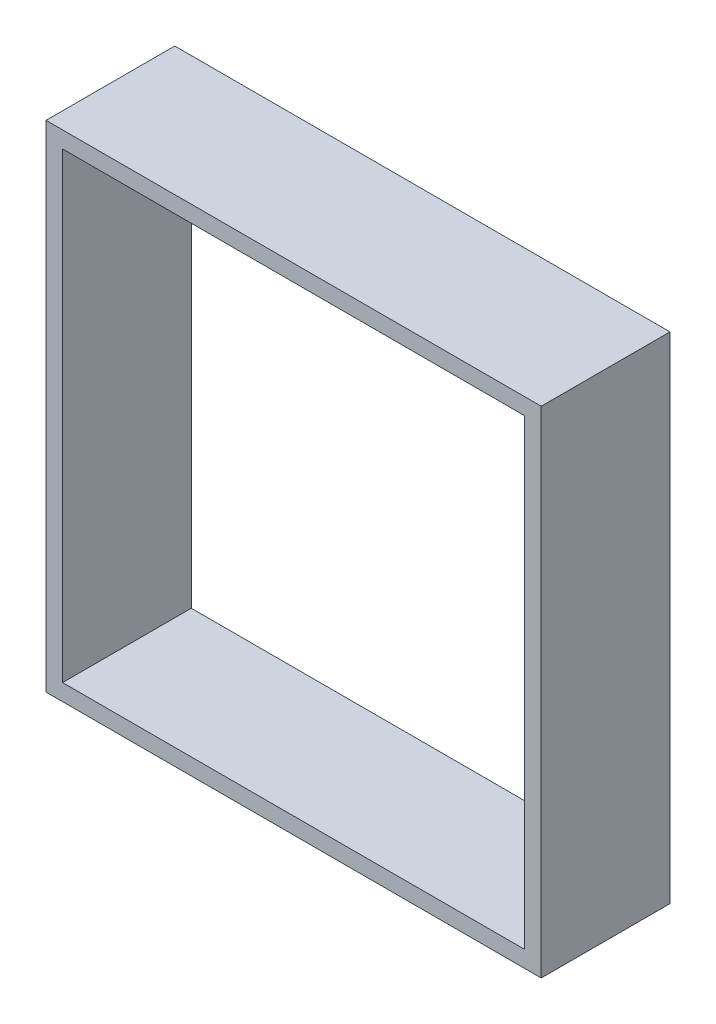
ISO-10303-21;
HEADER;
FILE_DESCRIPTION(('STEP AP214'),'2;1');
FILE_NAME('part.step','',(''),(''),'','','');
FILE_SCHEMA(('AUTOMOTIVE_DESIGN { 1 0 10303 214 1 1 1 1 }'));
ENDSEC;
DATA;
#1=APPLICATION_CONTEXT('core data for automotive mechanical design processes');
#2=APPLICATION_PROTOCOL_DEFINITION('international standard','automotive_design',2000,#1);
#3=PRODUCT_CONTEXT('',#1,'mechanical');
#4=PRODUCT('Part','Part','',(#3));
#5=PRODUCT_RELATED_PRODUCT_CATEGORY('part','',(#4));
#6=PRODUCT_DEFINITION_FORMATION('','',#4);
#7=PRODUCT_DEFINITION_CONTEXT('part definition',#1,'design');
#8=PRODUCT_DEFINITION('design','',#6,#7);
#9=PRODUCT_DEFINITION_SHAPE('','',#8);
#10=(LENGTH_UNIT() NAMED_UNIT(*) SI_UNIT(.MILLI.,.METRE.));
#11=(NAMED_UNIT(*) PLANE_ANGLE_UNIT() SI_UNIT($,.RADIAN.));
#12=(NAMED_UNIT(*) SI_UNIT($,.STERADIAN.) SOLID_ANGLE_UNIT());
#13=UNCERTAINTY_MEASURE_WITH_UNIT(LENGTH_MEASURE(1.E-05),#10,'distance_accuracy_value','');
#14=(GEOMETRIC_REPRESENTATION_CONTEXT(3) GLOBAL_UNCERTAINTY_ASSIGNED_CONTEXT((#13)) GLOBAL_UNIT_ASSIGNED_CONTEXT((#10,
#11,#12)) REPRESENTATION_CONTEXT('',''));
#15=CARTESIAN_POINT('',(0.,0.,0.));
#16=DIRECTION('',(0.,0.,1.));
#17=DIRECTION('',(1.,0.,0.));
#18=AXIS2_PLACEMENT_3D('',#15,#16,#17);
#19=CARTESIAN_POINT('',(0.,0.,7.8));
#20=DIRECTION('',(0.,0.,-1.));
#21=DIRECTION('',(-1.,0.,0.));
#22=AXIS2_PLACEMENT_3D('',#19,#20,#21);
#23=PLANE('',#22);
#24=DIRECTION('',(0.,1.,0.));
#25=VECTOR('',#24,1.);
#26=CARTESIAN_POINT('',(15.,-15.,7.8));
#27=LINE('',#26,#25);
#28=CARTESIAN_POINT('',(15.,-15.,7.8));
#29=VERTEX_POINT('',#28);
#30=CARTESIAN_POINT('',(15.,15.,7.8));
#31=VERTEX_POINT('',#30);
#32=EDGE_CURVE('E138',#29,#31,#27,.T.);
#33=ORIENTED_EDGE('',*,*,#32,.T.);
#34=DIRECTION('',(-1.,0.,0.));
#35=VECTOR('',#34,1.);
#36=CARTESIAN_POINT('',(-15.,15.,7.8));
#37=LINE('',#36,#35);
#38=CARTESIAN_POINT('',(-15.,15.,7.8));
#39=VERTEX_POINT('',#38);
#40=EDGE_CURVE('E141',#31,#39,#37,.T.);
#41=ORIENTED_EDGE('',*,*,#40,.T.);
#42=DIRECTION('',(0.,-1.,0.));
#43=VECTOR('',#42,1.);
#44=CARTESIAN_POINT('',(-15.,-15.,7.8));
#45=LINE('',#44,#43);
#46=CARTESIAN_POINT('',(-15.,-15.,7.8));
#47=VERTEX_POINT('',#46);
#48=EDGE_CURVE('E144',#39,#47,#45,.T.);
#49=ORIENTED_EDGE('',*,*,#48,.T.);
#50=DIRECTION('',(1.,0.,0.));
#51=VECTOR('',#50,1.);
#52=CARTESIAN_POINT('',(-15.,-15.,7.8));
#53=LINE('',#52,#51);
#54=EDGE_CURVE('E146',#47,#29,#53,.T.);
#55=ORIENTED_EDGE('',*,*,#54,.T.);
#56=EDGE_LOOP('',(#33,#41,#49,#55));
#57=FACE_BOUND('',#56,.T.);
#58=DIRECTION('',(0.,1.,0.));
#59=VECTOR('',#58,1.);
#60=CARTESIAN_POINT('',(14.,-14.,7.8));
#61=LINE('',#60,#59);
#62=CARTESIAN_POINT('',(14.,-14.,7.8));
#63=VERTEX_POINT('',#62);
#64=CARTESIAN_POINT('',(14.,14.,7.8));
#65=VERTEX_POINT('',#64);
#66=EDGE_CURVE('E102',#63,#65,#61,.T.);
#67=ORIENTED_EDGE('',*,*,#66,.F.);
#68=DIRECTION('',(1.,0.,0.));
#69=VECTOR('',#68,1.);
#70=CARTESIAN_POINT('',(-14.,-14.,7.8));
#71=LINE('',#70,#69);
#72=CARTESIAN_POINT('',(-14.,-14.,7.8));
#73=VERTEX_POINT('',#72);
#74=EDGE_CURVE('E124',#73,#63,#71,.T.);
#75=ORIENTED_EDGE('',*,*,#74,.F.);
#76=DIRECTION('',(0.,-1.,0.));
#77=VECTOR('',#76,1.);
#78=CARTESIAN_POINT('',(-14.,-14.,7.8));
#79=LINE('',#78,#77);
#80=CARTESIAN_POINT('',(-14.,14.,7.8));
#81=VERTEX_POINT('',#80);
#82=EDGE_CURVE('E122',#81,#73,#79,.T.);
#83=ORIENTED_EDGE('',*,*,#82,.F.);
#84=DIRECTION('',(-1.,0.,0.));
#85=VECTOR('',#84,1.);
#86=CARTESIAN_POINT('',(-14.,14.,7.8));
#87=LINE('',#86,#85);
#88=EDGE_CURVE('E110',#65,#81,#87,.T.);
#89=ORIENTED_EDGE('',*,*,#88,.F.);
#90=EDGE_LOOP('',(#67,#75,#83,#89));
#91=FACE_BOUND('',#90,.T.);
#92=ADVANCED_FACE('F37',(#57,#91),#23,.F.);
#93=CARTESIAN_POINT('',(0.,0.,0.));
#94=DIRECTION('',(0.,0.,-1.));
#95=DIRECTION('',(-1.,0.,0.));
#96=AXIS2_PLACEMENT_3D('',#93,#94,#95);
#97=PLANE('',#96);
#98=DIRECTION('',(0.,1.,0.));
#99=VECTOR('',#98,1.);
#100=CARTESIAN_POINT('',(15.,-15.,0.));
#101=LINE('',#100,#99);
#102=CARTESIAN_POINT('',(15.,-15.,0.));
#103=VERTEX_POINT('',#102);
#104=CARTESIAN_POINT('',(15.,15.,0.));
#105=VERTEX_POINT('',#104);
#106=EDGE_CURVE('E118',#103,#105,#101,.T.);
#107=ORIENTED_EDGE('',*,*,#106,.F.);
#108=DIRECTION('',(1.,0.,0.));
#109=VECTOR('',#108,1.);
#110=CARTESIAN_POINT('',(-15.,-15.,0.));
#111=LINE('',#110,#109);
#112=CARTESIAN_POINT('',(-15.,-15.,0.));
#113=VERTEX_POINT('',#112);
#114=EDGE_CURVE('E142',#113,#103,#111,.T.);
#115=ORIENTED_EDGE('',*,*,#114,.F.);
#116=DIRECTION('',(0.,-1.,0.));
#117=VECTOR('',#116,1.);
#118=CARTESIAN_POINT('',(-15.,-15.,0.));
#119=LINE('',#118,#117);
#120=CARTESIAN_POINT('',(-15.,15.,0.));
#121=VERTEX_POINT('',#120);
#122=EDGE_CURVE('E153',#121,#113,#119,.T.);
#123=ORIENTED_EDGE('',*,*,#122,.F.);
#124=DIRECTION('',(-1.,0.,0.));
#125=VECTOR('',#124,1.);
#126=CARTESIAN_POINT('',(-15.,15.,0.));
#127=LINE('',#126,#125);
#128=EDGE_CURVE('E151',#105,#121,#127,.T.);
#129=ORIENTED_EDGE('',*,*,#128,.F.);
#130=EDGE_LOOP('',(#107,#115,#123,#129));
#131=FACE_BOUND('',#130,.T.);
#132=DIRECTION('',(1.,0.,0.));
#133=VECTOR('',#132,1.);
#134=CARTESIAN_POINT('',(-14.,-14.,0.));
#135=LINE('',#134,#133);
#136=CARTESIAN_POINT('',(-14.,-14.,0.));
#137=VERTEX_POINT('',#136);
#138=CARTESIAN_POINT('',(14.,-14.,0.));
#139=VERTEX_POINT('',#138);
#140=EDGE_CURVE('E111',#137,#139,#135,.T.);
#141=ORIENTED_EDGE('',*,*,#140,.T.);
#142=DIRECTION('',(0.,1.,0.));
#143=VECTOR('',#142,1.);
#144=CARTESIAN_POINT('',(14.,-14.,0.));
#145=LINE('',#144,#143);
#146=CARTESIAN_POINT('',(14.,14.,0.));
#147=VERTEX_POINT('',#146);
#148=EDGE_CURVE('E60',#139,#147,#145,.T.);
#149=ORIENTED_EDGE('',*,*,#148,.T.);
#150=DIRECTION('',(-1.,0.,0.));
#151=VECTOR('',#150,1.);
#152=CARTESIAN_POINT('',(-14.,14.,0.));
#153=LINE('',#152,#151);
#154=CARTESIAN_POINT('',(-14.,14.,0.));
#155=VERTEX_POINT('',#154);
#156=EDGE_CURVE('E117',#147,#155,#153,.T.);
#157=ORIENTED_EDGE('',*,*,#156,.T.);
#158=DIRECTION('',(0.,-1.,0.));
#159=VECTOR('',#158,1.);
#160=CARTESIAN_POINT('',(-14.,-14.,0.));
#161=LINE('',#160,#159);
#162=EDGE_CURVE('E130',#155,#137,#161,.T.);
#163=ORIENTED_EDGE('',*,*,#162,.T.);
#164=EDGE_LOOP('',(#141,#149,#157,#163));
#165=FACE_BOUND('',#164,.T.);
#166=ADVANCED_FACE('F171',(#131,#165),#97,.T.);
#167=CARTESIAN_POINT('',(15.,-15.,7.8));
#168=DIRECTION('',(-1.,0.,0.));
#169=DIRECTION('',(0.,0.,1.));
#170=AXIS2_PLACEMENT_3D('',#167,#168,#169);
#171=PLANE('',#170);
#172=ORIENTED_EDGE('',*,*,#106,.T.);
#173=DIRECTION('',(0.,0.,-1.));
#174=VECTOR('',#173,1.);
#175=CARTESIAN_POINT('',(15.,15.,7.8));
#176=LINE('',#175,#174);
#177=EDGE_CURVE('E11',#31,#105,#176,.T.);
#178=ORIENTED_EDGE('',*,*,#177,.F.);
#179=ORIENTED_EDGE('',*,*,#32,.F.);
#180=DIRECTION('',(0.,0.,-1.));
#181=VECTOR('',#180,1.);
#182=CARTESIAN_POINT('',(15.,-15.,7.8));
#183=LINE('',#182,#181);
#184=EDGE_CURVE('E148',#29,#103,#183,.T.);
#185=ORIENTED_EDGE('',*,*,#184,.T.);
#186=EDGE_LOOP('',(#172,#178,#179,#185));
#187=FACE_BOUND('',#186,.T.);
#188=ADVANCED_FACE('F39',(#187),#171,.F.);
#189=CARTESIAN_POINT('',(-15.,15.,7.8));
#190=DIRECTION('',(0.,-1.,0.));
#191=DIRECTION('',(0.,0.,-1.));
#192=AXIS2_PLACEMENT_3D('',#189,#190,#191);
#193=PLANE('',#192);
#194=ORIENTED_EDGE('',*,*,#128,.T.);
#195=DIRECTION('',(0.,0.,-1.));
#196=VECTOR('',#195,1.);
#197=CARTESIAN_POINT('',(-15.,15.,7.8));
#198=LINE('',#197,#196);
#199=EDGE_CURVE('E45',#39,#121,#198,.T.);
#200=ORIENTED_EDGE('',*,*,#199,.F.);
#201=ORIENTED_EDGE('',*,*,#40,.F.);
#202=ORIENTED_EDGE('',*,*,#177,.T.);
#203=EDGE_LOOP('',(#194,#200,#201,#202));
#204=FACE_BOUND('',#203,.T.);
#205=ADVANCED_FACE('F181',(#204),#193,.F.);
#206=CARTESIAN_POINT('',(-15.,-15.,7.8));
#207=DIRECTION('',(1.,0.,0.));
#208=DIRECTION('',(0.,0.,-1.));
#209=AXIS2_PLACEMENT_3D('',#206,#207,#208);
#210=PLANE('',#209);
#211=ORIENTED_EDGE('',*,*,#122,.T.);
#212=DIRECTION('',(0.,0.,-1.));
#213=VECTOR('',#212,1.);
#214=CARTESIAN_POINT('',(-15.,-15.,7.8));
#215=LINE('',#214,#213);
#216=EDGE_CURVE('E158',#47,#113,#215,.T.);
#217=ORIENTED_EDGE('',*,*,#216,.F.);
#218=ORIENTED_EDGE('',*,*,#48,.F.);
#219=ORIENTED_EDGE('',*,*,#199,.T.);
#220=EDGE_LOOP('',(#211,#217,#218,#219));
#221=FACE_BOUND('',#220,.T.);
#222=ADVANCED_FACE('F165',(#221),#210,.F.);
#223=CARTESIAN_POINT('',(-15.,-15.,7.8));
#224=DIRECTION('',(0.,1.,0.));
#225=DIRECTION('',(0.,0.,1.));
#226=AXIS2_PLACEMENT_3D('',#223,#224,#225);
#227=PLANE('',#226);
#228=ORIENTED_EDGE('',*,*,#114,.T.);
#229=ORIENTED_EDGE('',*,*,#184,.F.);
#230=ORIENTED_EDGE('',*,*,#54,.F.);
#231=ORIENTED_EDGE('',*,*,#216,.T.);
#232=EDGE_LOOP('',(#228,#229,#230,#231));
#233=FACE_BOUND('',#232,.T.);
#234=ADVANCED_FACE('F175',(#233),#227,.F.);
#235=CARTESIAN_POINT('',(14.,-14.,7.8));
#236=DIRECTION('',(-1.,0.,0.));
#237=DIRECTION('',(0.,0.,1.));
#238=AXIS2_PLACEMENT_3D('',#235,#236,#237);
#239=PLANE('',#238);
#240=ORIENTED_EDGE('',*,*,#148,.F.);
#241=DIRECTION('',(0.,0.,-1.));
#242=VECTOR('',#241,1.);
#243=CARTESIAN_POINT('',(14.,-14.,7.8));
#244=LINE('',#243,#242);
#245=EDGE_CURVE('E106',#63,#139,#244,.T.);
#246=ORIENTED_EDGE('',*,*,#245,.F.);
#247=ORIENTED_EDGE('',*,*,#66,.T.);
#248=DIRECTION('',(0.,0.,-1.));
#249=VECTOR('',#248,1.);
#250=CARTESIAN_POINT('',(14.,14.,7.8));
#251=LINE('',#250,#249);
#252=EDGE_CURVE('E105',#65,#147,#251,.T.);
#253=ORIENTED_EDGE('',*,*,#252,.T.);
#254=EDGE_LOOP('',(#240,#246,#247,#253));
#255=FACE_BOUND('',#254,.T.);
#256=ADVANCED_FACE('F104',(#255),#239,.T.);
#257=CARTESIAN_POINT('',(-14.,14.,7.8));
#258=DIRECTION('',(0.,-1.,0.));
#259=DIRECTION('',(0.,0.,-1.));
#260=AXIS2_PLACEMENT_3D('',#257,#258,#259);
#261=PLANE('',#260);
#262=ORIENTED_EDGE('',*,*,#156,.F.);
#263=ORIENTED_EDGE('',*,*,#252,.F.);
#264=ORIENTED_EDGE('',*,*,#88,.T.);
#265=DIRECTION('',(0.,0.,-1.));
#266=VECTOR('',#265,1.);
#267=CARTESIAN_POINT('',(-14.,14.,7.8));
#268=LINE('',#267,#266);
#269=EDGE_CURVE('E119',#81,#155,#268,.T.);
#270=ORIENTED_EDGE('',*,*,#269,.T.);
#271=EDGE_LOOP('',(#262,#263,#264,#270));
#272=FACE_BOUND('',#271,.T.);
#273=ADVANCED_FACE('F114',(#272),#261,.T.);
#274=CARTESIAN_POINT('',(-14.,-14.,7.8));
#275=DIRECTION('',(1.,0.,0.));
#276=DIRECTION('',(0.,0.,-1.));
#277=AXIS2_PLACEMENT_3D('',#274,#275,#276);
#278=PLANE('',#277);
#279=ORIENTED_EDGE('',*,*,#162,.F.);
#280=ORIENTED_EDGE('',*,*,#269,.F.);
#281=ORIENTED_EDGE('',*,*,#82,.T.);
#282=DIRECTION('',(0.,0.,-1.));
#283=VECTOR('',#282,1.);
#284=CARTESIAN_POINT('',(-14.,-14.,7.8));
#285=LINE('',#284,#283);
#286=EDGE_CURVE('E52',#73,#137,#285,.T.);
#287=ORIENTED_EDGE('',*,*,#286,.T.);
#288=EDGE_LOOP('',(#279,#280,#281,#287));
#289=FACE_BOUND('',#288,.T.);
#290=ADVANCED_FACE('F204',(#289),#278,.T.);
#291=CARTESIAN_POINT('',(-14.,-14.,7.8));
#292=DIRECTION('',(0.,1.,0.));
#293=DIRECTION('',(0.,0.,1.));
#294=AXIS2_PLACEMENT_3D('',#291,#292,#293);
#295=PLANE('',#294);
#296=ORIENTED_EDGE('',*,*,#140,.F.);
#297=ORIENTED_EDGE('',*,*,#286,.F.);
#298=ORIENTED_EDGE('',*,*,#74,.T.);
#299=ORIENTED_EDGE('',*,*,#245,.T.);
#300=EDGE_LOOP('',(#296,#297,#298,#299));
#301=FACE_BOUND('',#300,.T.);
#302=ADVANCED_FACE('F208',(#301),#295,.T.);
#303=CLOSED_SHELL('',(#92,#166,#188,#205,#222,#234,#256,#273,#290,#302));
#304=MANIFOLD_SOLID_BREP('B2',#303);
#305=ADVANCED_BREP_SHAPE_REPRESENTATION('',(#18,#304),#14);
#306=SHAPE_DEFINITION_REPRESENTATION(#9,#305);
ENDSEC;
END-ISO-10303-21;
